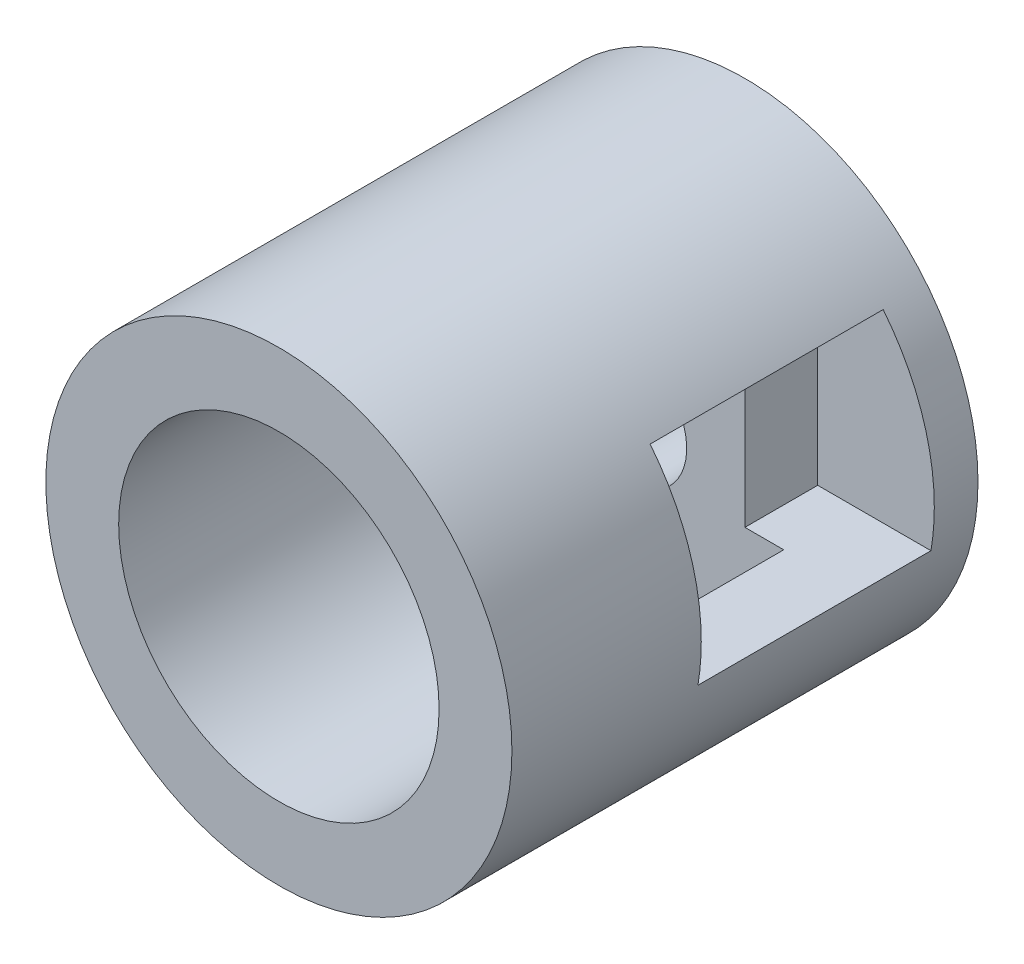
ISO-10303-21;
HEADER;
FILE_DESCRIPTION(('STEP AP214'),'2;1');
FILE_NAME('part.step','',(''),(''),'','','');
FILE_SCHEMA(('AUTOMOTIVE_DESIGN { 1 0 10303 214 1 1 1 1 }'));
ENDSEC;
DATA;
#1=APPLICATION_CONTEXT('core data for automotive mechanical design processes');
#2=APPLICATION_PROTOCOL_DEFINITION('international standard','automotive_design',2000,#1);
#3=PRODUCT_CONTEXT('',#1,'mechanical');
#4=PRODUCT('Part','Part','',(#3));
#5=PRODUCT_RELATED_PRODUCT_CATEGORY('part','',(#4));
#6=PRODUCT_DEFINITION_FORMATION('','',#4);
#7=PRODUCT_DEFINITION_CONTEXT('part definition',#1,'design');
#8=PRODUCT_DEFINITION('design','',#6,#7);
#9=PRODUCT_DEFINITION_SHAPE('','',#8);
#10=(LENGTH_UNIT() NAMED_UNIT(*) SI_UNIT(.MILLI.,.METRE.));
#11=(NAMED_UNIT(*) PLANE_ANGLE_UNIT() SI_UNIT($,.RADIAN.));
#12=(NAMED_UNIT(*) SI_UNIT($,.STERADIAN.) SOLID_ANGLE_UNIT());
#13=UNCERTAINTY_MEASURE_WITH_UNIT(LENGTH_MEASURE(1.E-05),#10,'distance_accuracy_value','');
#14=(GEOMETRIC_REPRESENTATION_CONTEXT(3) GLOBAL_UNCERTAINTY_ASSIGNED_CONTEXT((#13)) GLOBAL_UNIT_ASSIGNED_CONTEXT((#10,
#11,#12)) REPRESENTATION_CONTEXT('',''));
#15=CARTESIAN_POINT('',(0.,0.,0.));
#16=DIRECTION('',(0.,0.,1.));
#17=DIRECTION('',(1.,0.,0.));
#18=AXIS2_PLACEMENT_3D('',#15,#16,#17);
#19=CARTESIAN_POINT('',(0.,0.,-6.));
#20=DIRECTION('',(0.,0.,1.));
#21=DIRECTION('',(1.,0.,0.));
#22=AXIS2_PLACEMENT_3D('',#19,#20,#21);
#23=CYLINDRICAL_SURFACE('',#22,4.);
#24=CARTESIAN_POINT('',(0.,0.,0.));
#25=DIRECTION('',(0.,0.,1.));
#26=DIRECTION('',(1.,0.,0.));
#27=AXIS2_PLACEMENT_3D('',#24,#25,#26);
#28=CIRCLE('',#27,4.);
#29=CARTESIAN_POINT('',(4.,0.,0.));
#30=VERTEX_POINT('',#29);
#31=EDGE_CURVE('E161',#30,#30,#28,.T.);
#32=ORIENTED_EDGE('',*,*,#31,.F.);
#33=EDGE_LOOP('',(#32));
#34=FACE_BOUND('',#33,.T.);
#35=CARTESIAN_POINT('',(0.,0.,-8.));
#36=DIRECTION('',(0.,0.,-1.));
#37=DIRECTION('',(-1.,0.,0.));
#38=AXIS2_PLACEMENT_3D('',#35,#36,#37);
#39=CIRCLE('',#38,4.);
#40=CARTESIAN_POINT('',(-4.,0.,-8.));
#41=VERTEX_POINT('',#40);
#42=EDGE_CURVE('E149',#41,#41,#39,.T.);
#43=ORIENTED_EDGE('',*,*,#42,.F.);
#44=EDGE_LOOP('',(#43));
#45=FACE_BOUND('',#44,.T.);
#46=CARTESIAN_POINT('',(0.,0.,-7.25));
#47=DIRECTION('',(0.,0.,-1.));
#48=DIRECTION('',(-1.,0.,0.));
#49=AXIS2_PLACEMENT_3D('',#46,#47,#48);
#50=CIRCLE('',#49,4.);
#51=CARTESIAN_POINT('',(3.94263553983881,-0.674999999999972,-7.25));
#52=VERTEX_POINT('',#51);
#53=CARTESIAN_POINT('',(3.12249899919918,2.50000000000002,-7.25));
#54=VERTEX_POINT('',#53);
#55=EDGE_CURVE('E11',#52,#54,#50,.F.);
#56=ORIENTED_EDGE('',*,*,#55,.F.);
#57=DIRECTION('',(0.,0.,1.));
#58=VECTOR('',#57,1.);
#59=CARTESIAN_POINT('',(3.94263553983881,-0.674999999999972,-6.));
#60=LINE('',#59,#58);
#61=CARTESIAN_POINT('',(3.94263553983881,-0.674999999999972,-3.25));
#62=VERTEX_POINT('',#61);
#63=EDGE_CURVE('E99',#52,#62,#60,.T.);
#64=ORIENTED_EDGE('',*,*,#63,.T.);
#65=CARTESIAN_POINT('',(0.,0.,-3.25));
#66=DIRECTION('',(0.,0.,-1.));
#67=DIRECTION('',(0.,1.,0.));
#68=AXIS2_PLACEMENT_3D('',#65,#66,#67);
#69=CIRCLE('',#68,4.);
#70=CARTESIAN_POINT('',(3.12249899919918,2.50000000000002,-3.25));
#71=VERTEX_POINT('',#70);
#72=EDGE_CURVE('E140',#62,#71,#69,.F.);
#73=ORIENTED_EDGE('',*,*,#72,.T.);
#74=DIRECTION('',(0.,0.,1.));
#75=VECTOR('',#74,1.);
#76=CARTESIAN_POINT('',(3.12249899919918,2.50000000000002,-6.));
#77=LINE('',#76,#75);
#78=EDGE_CURVE('E47',#54,#71,#77,.T.);
#79=ORIENTED_EDGE('',*,*,#78,.F.);
#80=EDGE_LOOP('',(#56,#64,#73,#79));
#81=FACE_BOUND('',#80,.T.);
#82=ADVANCED_FACE('F39',(#34,#45,#81),#23,.T.);
#83=CARTESIAN_POINT('',(0.,0.,0.));
#84=DIRECTION('',(0.,0.,-1.));
#85=DIRECTION('',(-1.,0.,0.));
#86=AXIS2_PLACEMENT_3D('',#83,#84,#85);
#87=CYLINDRICAL_SURFACE('',#86,2.75);
#88=CARTESIAN_POINT('',(0.,0.,0.));
#89=DIRECTION('',(0.,0.,-1.));
#90=DIRECTION('',(-1.,0.,0.));
#91=AXIS2_PLACEMENT_3D('',#88,#89,#90);
#92=CIRCLE('',#91,2.75);
#93=CARTESIAN_POINT('',(-2.75,0.,0.));
#94=VERTEX_POINT('',#93);
#95=EDGE_CURVE('E157',#94,#94,#92,.T.);
#96=ORIENTED_EDGE('',*,*,#95,.F.);
#97=EDGE_LOOP('',(#96));
#98=FACE_BOUND('',#97,.T.);
#99=DIRECTION('',(0.,0.,-1.));
#100=VECTOR('',#99,1.);
#101=CARTESIAN_POINT('',(2.66587227751069,-0.67499999999998,0.));
#102=LINE('',#101,#100);
#103=CARTESIAN_POINT('',(2.66587227751069,-0.674999999999981,-6.));
#104=VERTEX_POINT('',#103);
#105=CARTESIAN_POINT('',(2.66587227751069,-0.674999999999981,-3.25));
#106=VERTEX_POINT('',#105);
#107=EDGE_CURVE('E135',#104,#106,#102,.F.);
#108=ORIENTED_EDGE('',*,*,#107,.F.);
#109=CARTESIAN_POINT('',(0.,0.,-6.));
#110=DIRECTION('',(0.,0.,-1.));
#111=DIRECTION('',(-1.,0.,0.));
#112=AXIS2_PLACEMENT_3D('',#109,#110,#111);
#113=CIRCLE('',#112,2.75);
#114=CARTESIAN_POINT('',(1.99872648533735,1.88880714653747,-6.));
#115=VERTEX_POINT('',#114);
#116=EDGE_CURVE('E156',#104,#115,#113,.T.);
#117=ORIENTED_EDGE('',*,*,#116,.T.);
#118=DIRECTION('',(0.,0.,-1.));
#119=VECTOR('',#118,1.);
#120=CARTESIAN_POINT('',(1.99872648533735,1.88880714653747,0.));
#121=LINE('',#120,#119);
#122=CARTESIAN_POINT('',(1.99872648533735,1.88880714653747,-3.25));
#123=VERTEX_POINT('',#122);
#124=EDGE_CURVE('E62',#115,#123,#121,.F.);
#125=ORIENTED_EDGE('',*,*,#124,.T.);
#126=CARTESIAN_POINT('',(0.,0.,-3.25));
#127=DIRECTION('',(0.,0.,-1.));
#128=DIRECTION('',(0.,1.,0.));
#129=AXIS2_PLACEMENT_3D('',#126,#127,#128);
#130=CIRCLE('',#129,2.75);
#131=EDGE_CURVE('E173',#106,#123,#130,.F.);
#132=ORIENTED_EDGE('',*,*,#131,.F.);
#133=EDGE_LOOP('',(#108,#117,#125,#132));
#134=FACE_BOUND('',#133,.T.);
#135=ADVANCED_FACE('F185',(#98,#134),#87,.F.);
#136=CARTESIAN_POINT('',(0.,0.,-6.));
#137=DIRECTION('',(0.,0.,-1.));
#138=DIRECTION('',(-1.,0.,0.));
#139=AXIS2_PLACEMENT_3D('',#136,#137,#138);
#140=PLANE('',#139);
#141=CARTESIAN_POINT('',(0.,0.,-6.));
#142=DIRECTION('',(0.,0.,-1.));
#143=DIRECTION('',(-1.,0.,0.));
#144=AXIS2_PLACEMENT_3D('',#141,#142,#143);
#145=CIRCLE('',#144,1.);
#146=CARTESIAN_POINT('',(-1.,0.,-6.));
#147=VERTEX_POINT('',#146);
#148=EDGE_CURVE('E145',#147,#147,#145,.T.);
#149=ORIENTED_EDGE('',*,*,#148,.T.);
#150=EDGE_LOOP('',(#149));
#151=FACE_BOUND('',#150,.T.);
#152=DIRECTION('',(1.,0.,0.));
#153=VECTOR('',#152,1.);
#154=CARTESIAN_POINT('',(0.,-0.674999999999999,-6.));
#155=LINE('',#154,#153);
#156=CARTESIAN_POINT('',(1.99872648533736,-0.674999999999985,-6.));
#157=VERTEX_POINT('',#156);
#158=EDGE_CURVE('E170',#157,#104,#155,.T.);
#159=ORIENTED_EDGE('',*,*,#158,.F.);
#160=DIRECTION('',(0.,1.,0.));
#161=VECTOR('',#160,1.);
#162=CARTESIAN_POINT('',(1.99872648533736,0.,-6.));
#163=LINE('',#162,#161);
#164=EDGE_CURVE('E110',#157,#115,#163,.T.);
#165=ORIENTED_EDGE('',*,*,#164,.T.);
#166=ORIENTED_EDGE('',*,*,#116,.F.);
#167=EDGE_LOOP('',(#159,#165,#166));
#168=FACE_BOUND('',#167,.T.);
#169=ADVANCED_FACE('F187',(#151,#168),#140,.F.);
#170=CARTESIAN_POINT('',(0.,0.,0.));
#171=DIRECTION('',(0.,0.,1.));
#172=DIRECTION('',(1.,0.,0.));
#173=AXIS2_PLACEMENT_3D('',#170,#171,#172);
#174=PLANE('',#173);
#175=ORIENTED_EDGE('',*,*,#95,.T.);
#176=EDGE_LOOP('',(#175));
#177=FACE_BOUND('',#176,.T.);
#178=ORIENTED_EDGE('',*,*,#31,.T.);
#179=EDGE_LOOP('',(#178));
#180=FACE_BOUND('',#179,.T.);
#181=ADVANCED_FACE('F189',(#177,#180),#174,.T.);
#182=CARTESIAN_POINT('',(0.,0.,-8.));
#183=DIRECTION('',(0.,0.,-1.));
#184=DIRECTION('',(-1.,0.,0.));
#185=AXIS2_PLACEMENT_3D('',#182,#183,#184);
#186=PLANE('',#185);
#187=CARTESIAN_POINT('',(0.,0.,-8.));
#188=DIRECTION('',(0.,0.,-1.));
#189=DIRECTION('',(-1.,0.,0.));
#190=AXIS2_PLACEMENT_3D('',#187,#188,#189);
#191=CIRCLE('',#190,1.);
#192=CARTESIAN_POINT('',(-1.,0.,-8.));
#193=VERTEX_POINT('',#192);
#194=EDGE_CURVE('E144',#193,#193,#191,.T.);
#195=ORIENTED_EDGE('',*,*,#194,.F.);
#196=EDGE_LOOP('',(#195));
#197=FACE_BOUND('',#196,.T.);
#198=ORIENTED_EDGE('',*,*,#42,.T.);
#199=EDGE_LOOP('',(#198));
#200=FACE_BOUND('',#199,.T.);
#201=ADVANCED_FACE('F196',(#197,#200),#186,.T.);
#202=CARTESIAN_POINT('',(0.,0.,-6.));
#203=DIRECTION('',(0.,0.,-1.));
#204=DIRECTION('',(-1.,0.,0.));
#205=AXIS2_PLACEMENT_3D('',#202,#203,#204);
#206=CYLINDRICAL_SURFACE('',#205,1.);
#207=ORIENTED_EDGE('',*,*,#148,.F.);
#208=EDGE_LOOP('',(#207));
#209=FACE_BOUND('',#208,.T.);
#210=ORIENTED_EDGE('',*,*,#194,.T.);
#211=EDGE_LOOP('',(#210));
#212=FACE_BOUND('',#211,.T.);
#213=ADVANCED_FACE('F210',(#209,#212),#206,.F.);
#214=CARTESIAN_POINT('',(5.99872648533734,2.50000000000004,-3.25));
#215=DIRECTION('',(0.,0.,-1.));
#216=DIRECTION('',(0.,1.,0.));
#217=AXIS2_PLACEMENT_3D('',#214,#215,#216);
#218=PLANE('',#217);
#219=DIRECTION('',(-1.,0.,0.));
#220=VECTOR('',#219,1.);
#221=CARTESIAN_POINT('',(5.99872648533736,-0.674999999999957,-3.25));
#222=LINE('',#221,#220);
#223=EDGE_CURVE('E125',#62,#106,#222,.T.);
#224=ORIENTED_EDGE('',*,*,#223,.T.);
#225=ORIENTED_EDGE('',*,*,#131,.T.);
#226=DIRECTION('',(0.,-1.,0.));
#227=VECTOR('',#226,1.);
#228=CARTESIAN_POINT('',(1.99872648533734,2.50000000000001,-3.25));
#229=LINE('',#228,#227);
#230=CARTESIAN_POINT('',(1.99872648533734,2.50000000000001,-3.25));
#231=VERTEX_POINT('',#230);
#232=EDGE_CURVE('E120',#231,#123,#229,.T.);
#233=ORIENTED_EDGE('',*,*,#232,.F.);
#234=DIRECTION('',(-1.,0.,0.));
#235=VECTOR('',#234,1.);
#236=CARTESIAN_POINT('',(5.99872648533734,2.50000000000004,-3.25));
#237=LINE('',#236,#235);
#238=EDGE_CURVE('E54',#71,#231,#237,.T.);
#239=ORIENTED_EDGE('',*,*,#238,.F.);
#240=ORIENTED_EDGE('',*,*,#72,.F.);
#241=EDGE_LOOP('',(#224,#225,#233,#239,#240));
#242=FACE_BOUND('',#241,.T.);
#243=ADVANCED_FACE('F180',(#242),#218,.T.);
#244=CARTESIAN_POINT('',(5.99872648533736,-0.674999999999957,-3.25));
#245=DIRECTION('',(0.,1.,0.));
#246=DIRECTION('',(-1.,0.,0.));
#247=AXIS2_PLACEMENT_3D('',#244,#245,#246);
#248=PLANE('',#247);
#249=DIRECTION('',(-1.,0.,0.));
#250=VECTOR('',#249,1.);
#251=CARTESIAN_POINT('',(5.99872648533736,-0.674999999999957,-7.25));
#252=LINE('',#251,#250);
#253=CARTESIAN_POINT('',(1.99872648533736,-0.674999999999985,-7.25));
#254=VERTEX_POINT('',#253);
#255=EDGE_CURVE('E92',#52,#254,#252,.T.);
#256=ORIENTED_EDGE('',*,*,#255,.T.);
#257=DIRECTION('',(0.,0.,-1.));
#258=VECTOR('',#257,1.);
#259=CARTESIAN_POINT('',(1.99872648533736,-0.674999999999985,-3.25));
#260=LINE('',#259,#258);
#261=EDGE_CURVE('E95',#157,#254,#260,.T.);
#262=ORIENTED_EDGE('',*,*,#261,.F.);
#263=ORIENTED_EDGE('',*,*,#158,.T.);
#264=ORIENTED_EDGE('',*,*,#107,.T.);
#265=ORIENTED_EDGE('',*,*,#223,.F.);
#266=ORIENTED_EDGE('',*,*,#63,.F.);
#267=EDGE_LOOP('',(#256,#262,#263,#264,#265,#266));
#268=FACE_BOUND('',#267,.T.);
#269=ADVANCED_FACE('F94',(#268),#248,.T.);
#270=CARTESIAN_POINT('',(1.99872648533736,0.,0.));
#271=DIRECTION('',(-1.,0.,0.));
#272=DIRECTION('',(0.,-1.,0.));
#273=AXIS2_PLACEMENT_3D('',#270,#271,#272);
#274=PLANE('',#273);
#275=ORIENTED_EDGE('',*,*,#164,.F.);
#276=ORIENTED_EDGE('',*,*,#261,.T.);
#277=DIRECTION('',(0.,-1.,0.));
#278=VECTOR('',#277,1.);
#279=CARTESIAN_POINT('',(1.99872648533734,2.50000000000001,-7.25));
#280=LINE('',#279,#278);
#281=CARTESIAN_POINT('',(1.99872648533734,2.50000000000001,-7.25));
#282=VERTEX_POINT('',#281);
#283=EDGE_CURVE('E109',#282,#254,#280,.T.);
#284=ORIENTED_EDGE('',*,*,#283,.F.);
#285=DIRECTION('',(0.,0.,-1.));
#286=VECTOR('',#285,1.);
#287=CARTESIAN_POINT('',(1.99872648533734,2.50000000000001,-3.25));
#288=LINE('',#287,#286);
#289=EDGE_CURVE('E117',#231,#282,#288,.T.);
#290=ORIENTED_EDGE('',*,*,#289,.F.);
#291=ORIENTED_EDGE('',*,*,#232,.T.);
#292=ORIENTED_EDGE('',*,*,#124,.F.);
#293=EDGE_LOOP('',(#275,#276,#284,#290,#291,#292));
#294=FACE_BOUND('',#293,.T.);
#295=ADVANCED_FACE('F107',(#294),#274,.F.);
#296=CARTESIAN_POINT('',(5.99872648533734,2.50000000000004,-7.25));
#297=DIRECTION('',(0.,0.,-1.));
#298=DIRECTION('',(-1.,0.,0.));
#299=AXIS2_PLACEMENT_3D('',#296,#297,#298);
#300=PLANE('',#299);
#301=ORIENTED_EDGE('',*,*,#55,.T.);
#302=DIRECTION('',(-1.,0.,0.));
#303=VECTOR('',#302,1.);
#304=CARTESIAN_POINT('',(5.99872648533734,2.50000000000004,-7.25));
#305=LINE('',#304,#303);
#306=EDGE_CURVE('E104',#54,#282,#305,.T.);
#307=ORIENTED_EDGE('',*,*,#306,.T.);
#308=ORIENTED_EDGE('',*,*,#283,.T.);
#309=ORIENTED_EDGE('',*,*,#255,.F.);
#310=EDGE_LOOP('',(#301,#307,#308,#309));
#311=FACE_BOUND('',#310,.T.);
#312=ADVANCED_FACE('F113',(#311),#300,.F.);
#313=CARTESIAN_POINT('',(5.99872648533734,2.50000000000004,-3.25));
#314=DIRECTION('',(0.,1.,0.));
#315=DIRECTION('',(-1.,0.,0.));
#316=AXIS2_PLACEMENT_3D('',#313,#314,#315);
#317=PLANE('',#316);
#318=ORIENTED_EDGE('',*,*,#78,.T.);
#319=ORIENTED_EDGE('',*,*,#238,.T.);
#320=ORIENTED_EDGE('',*,*,#289,.T.);
#321=ORIENTED_EDGE('',*,*,#306,.F.);
#322=EDGE_LOOP('',(#318,#319,#320,#321));
#323=FACE_BOUND('',#322,.T.);
#324=ADVANCED_FACE('F178',(#323),#317,.F.);
#325=CLOSED_SHELL('',(#82,#135,#169,#181,#201,#213,#243,#269,#295,#312,#324));
#326=MANIFOLD_SOLID_BREP('B2',#325);
#327=ADVANCED_BREP_SHAPE_REPRESENTATION('',(#18,#326),#14);
#328=SHAPE_DEFINITION_REPRESENTATION(#9,#327);
ENDSEC;
END-ISO-10303-21;
